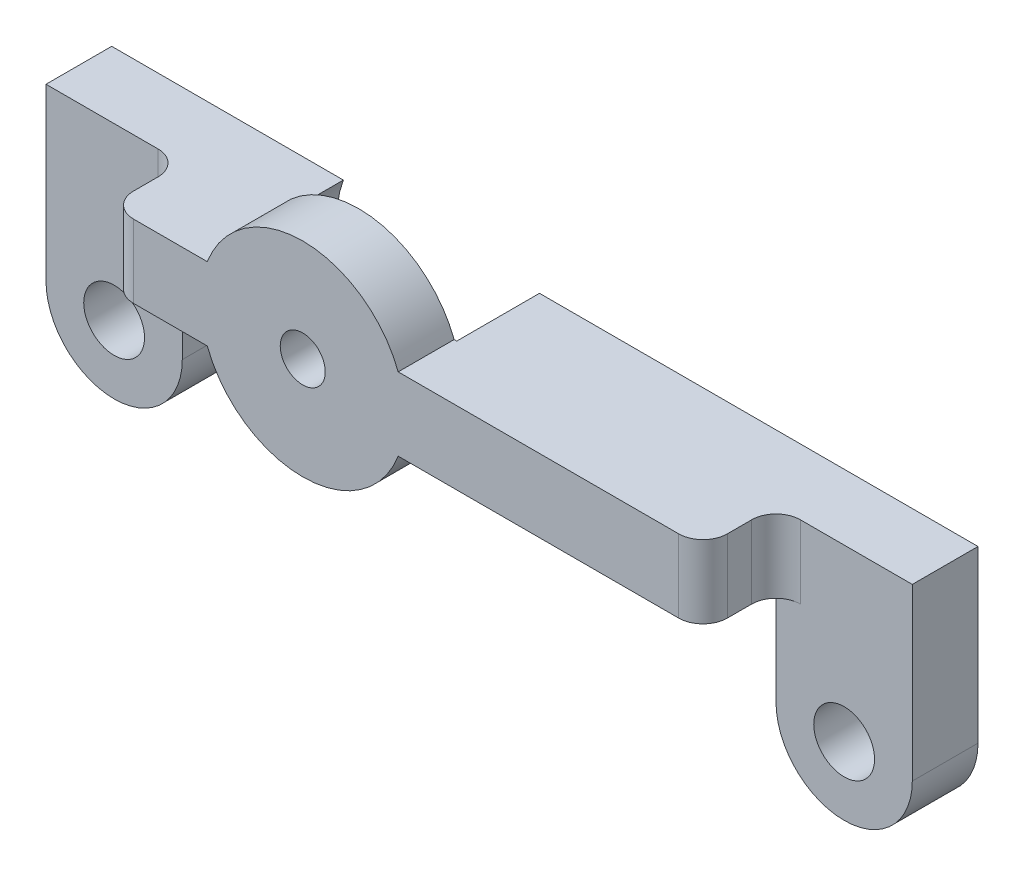
ISO-10303-21;
HEADER;
FILE_DESCRIPTION(('STEP AP214'),'2;1');
FILE_NAME('part.step','',(''),(''),'','','');
FILE_SCHEMA(('AUTOMOTIVE_DESIGN { 1 0 10303 214 1 1 1 1 }'));
ENDSEC;
DATA;
#1=APPLICATION_CONTEXT('core data for automotive mechanical design processes');
#2=APPLICATION_PROTOCOL_DEFINITION('international standard','automotive_design',2000,#1);
#3=PRODUCT_CONTEXT('',#1,'mechanical');
#4=PRODUCT('Part','Part','',(#3));
#5=PRODUCT_RELATED_PRODUCT_CATEGORY('part','',(#4));
#6=PRODUCT_DEFINITION_FORMATION('','',#4);
#7=PRODUCT_DEFINITION_CONTEXT('part definition',#1,'design');
#8=PRODUCT_DEFINITION('design','',#6,#7);
#9=PRODUCT_DEFINITION_SHAPE('','',#8);
#10=(LENGTH_UNIT() NAMED_UNIT(*) SI_UNIT(.MILLI.,.METRE.));
#11=(NAMED_UNIT(*) PLANE_ANGLE_UNIT() SI_UNIT($,.RADIAN.));
#12=(NAMED_UNIT(*) SI_UNIT($,.STERADIAN.) SOLID_ANGLE_UNIT());
#13=UNCERTAINTY_MEASURE_WITH_UNIT(LENGTH_MEASURE(1.E-05),#10,'distance_accuracy_value','');
#14=(GEOMETRIC_REPRESENTATION_CONTEXT(3) GLOBAL_UNCERTAINTY_ASSIGNED_CONTEXT((#13)) GLOBAL_UNIT_ASSIGNED_CONTEXT((#10,
#11,#12)) REPRESENTATION_CONTEXT('',''));
#15=CARTESIAN_POINT('',(0.,0.,0.));
#16=DIRECTION('',(0.,0.,1.));
#17=DIRECTION('',(1.,0.,0.));
#18=AXIS2_PLACEMENT_3D('',#15,#16,#17);
#19=CARTESIAN_POINT('',(-4.24999999999999,-1.06771488469601,7.7));
#20=DIRECTION('',(0.,0.,-1.));
#21=DIRECTION('',(-1.,0.,0.));
#22=AXIS2_PLACEMENT_3D('',#19,#20,#21);
#23=CYLINDRICAL_SURFACE('',#22,4.2);
#24=CARTESIAN_POINT('',(-4.24999999999999,-1.06771488469601,5.7));
#25=DIRECTION('',(0.,0.,1.));
#26=DIRECTION('',(1.,0.,0.));
#27=AXIS2_PLACEMENT_3D('',#24,#25,#26);
#28=CIRCLE('',#27,4.2);
#29=CARTESIAN_POINT('',(-0.326990950813383,0.432285115303986,5.7));
#30=VERTEX_POINT('',#29);
#31=CARTESIAN_POINT('',(-8.1730090491866,0.432285115303986,5.7));
#32=VERTEX_POINT('',#31);
#33=EDGE_CURVE('E213',#30,#32,#28,.T.);
#34=ORIENTED_EDGE('',*,*,#33,.F.);
#35=DIRECTION('',(0.,0.,-1.));
#36=VECTOR('',#35,1.);
#37=CARTESIAN_POINT('',(-0.326990950813383,0.432285115303986,7.7));
#38=LINE('',#37,#36);
#39=CARTESIAN_POINT('',(-0.326990950813383,0.432285115303986,3.4));
#40=VERTEX_POINT('',#39);
#41=EDGE_CURVE('E223',#30,#40,#38,.T.);
#42=ORIENTED_EDGE('',*,*,#41,.T.);
#43=CARTESIAN_POINT('',(-4.24999999999999,-1.06771488469601,3.4));
#44=DIRECTION('',(0.,0.,-1.));
#45=DIRECTION('',(-1.,0.,0.));
#46=AXIS2_PLACEMENT_3D('',#43,#44,#45);
#47=CIRCLE('',#46,4.2);
#48=CARTESIAN_POINT('',(-8.1730090491866,0.432285115303986,3.4));
#49=VERTEX_POINT('',#48);
#50=EDGE_CURVE('E409',#49,#40,#47,.T.);
#51=ORIENTED_EDGE('',*,*,#50,.F.);
#52=DIRECTION('',(0.,0.,-1.));
#53=VECTOR('',#52,1.);
#54=CARTESIAN_POINT('',(-8.1730090491866,0.432285115303986,7.7));
#55=LINE('',#54,#53);
#56=EDGE_CURVE('E225',#32,#49,#55,.T.);
#57=ORIENTED_EDGE('',*,*,#56,.F.);
#58=EDGE_LOOP('',(#34,#42,#51,#57));
#59=FACE_BOUND('',#58,.T.);
#60=ADVANCED_FACE('F50',(#59),#23,.T.);
#61=CARTESIAN_POINT('',(-4.24999999999999,-1.06771488469601,7.7));
#62=DIRECTION('',(0.,0.,-1.));
#63=DIRECTION('',(-1.,0.,0.));
#64=AXIS2_PLACEMENT_3D('',#61,#62,#63);
#65=CYLINDRICAL_SURFACE('',#64,4.2);
#66=CARTESIAN_POINT('',(-4.24999999999999,-1.06771488469601,5.7));
#67=DIRECTION('',(0.,0.,1.));
#68=DIRECTION('',(1.,0.,0.));
#69=AXIS2_PLACEMENT_3D('',#66,#67,#68);
#70=CIRCLE('',#69,4.2);
#71=CARTESIAN_POINT('',(-8.1730090491866,-2.56771488469601,5.7));
#72=VERTEX_POINT('',#71);
#73=CARTESIAN_POINT('',(-0.326990950813383,-2.56771488469601,5.7));
#74=VERTEX_POINT('',#73);
#75=EDGE_CURVE('E474',#72,#74,#70,.T.);
#76=ORIENTED_EDGE('',*,*,#75,.F.);
#77=DIRECTION('',(0.,0.,-1.));
#78=VECTOR('',#77,1.);
#79=CARTESIAN_POINT('',(-8.1730090491866,-2.56771488469601,7.7));
#80=LINE('',#79,#78);
#81=CARTESIAN_POINT('',(-8.1730090491866,-2.56771488469601,3.4));
#82=VERTEX_POINT('',#81);
#83=EDGE_CURVE('E318',#72,#82,#80,.T.);
#84=ORIENTED_EDGE('',*,*,#83,.T.);
#85=CARTESIAN_POINT('',(-4.24999999999999,-1.06771488469601,3.4));
#86=DIRECTION('',(0.,0.,-1.));
#87=DIRECTION('',(-1.,0.,0.));
#88=AXIS2_PLACEMENT_3D('',#85,#86,#87);
#89=CIRCLE('',#88,4.2);
#90=CARTESIAN_POINT('',(-0.326990950813383,-2.56771488469601,3.4));
#91=VERTEX_POINT('',#90);
#92=EDGE_CURVE('E395',#91,#82,#89,.T.);
#93=ORIENTED_EDGE('',*,*,#92,.F.);
#94=DIRECTION('',(0.,0.,-1.));
#95=VECTOR('',#94,1.);
#96=CARTESIAN_POINT('',(-0.326990950813383,-2.56771488469601,7.7));
#97=LINE('',#96,#95);
#98=EDGE_CURVE('E321',#74,#91,#97,.T.);
#99=ORIENTED_EDGE('',*,*,#98,.F.);
#100=EDGE_LOOP('',(#76,#84,#93,#99));
#101=FACE_BOUND('',#100,.T.);
#102=ADVANCED_FACE('F400',(#101),#65,.T.);
#103=CARTESIAN_POINT('',(-4.24999999999999,-1.06771488469601,7.7));
#104=DIRECTION('',(0.,0.,-1.));
#105=DIRECTION('',(-1.,0.,0.));
#106=AXIS2_PLACEMENT_3D('',#103,#104,#105);
#107=CYLINDRICAL_SURFACE('',#106,0.925);
#108=CARTESIAN_POINT('',(-4.24999999999999,-1.06771488469601,3.4));
#109=DIRECTION('',(0.,0.,-1.));
#110=DIRECTION('',(-1.,0.,0.));
#111=AXIS2_PLACEMENT_3D('',#108,#109,#110);
#112=CIRCLE('',#111,0.925);
#113=CARTESIAN_POINT('',(-5.17499999999999,-1.06771488469601,3.4));
#114=VERTEX_POINT('',#113);
#115=EDGE_CURVE('E241',#114,#114,#112,.T.);
#116=ORIENTED_EDGE('',*,*,#115,.T.);
#117=EDGE_LOOP('',(#116));
#118=FACE_BOUND('',#117,.T.);
#119=CARTESIAN_POINT('',(-4.24999999999999,-1.06771488469601,5.7));
#120=DIRECTION('',(0.,0.,1.));
#121=DIRECTION('',(1.,0.,0.));
#122=AXIS2_PLACEMENT_3D('',#119,#120,#121);
#123=CIRCLE('',#122,0.925);
#124=CARTESIAN_POINT('',(-3.32499999999999,-1.06771488469601,5.7));
#125=VERTEX_POINT('',#124);
#126=EDGE_CURVE('E479',#125,#125,#123,.T.);
#127=ORIENTED_EDGE('',*,*,#126,.T.);
#128=EDGE_LOOP('',(#127));
#129=FACE_BOUND('',#128,.T.);
#130=ADVANCED_FACE('F442',(#118,#129),#107,.F.);
#131=CARTESIAN_POINT('',(0.,0.432285115303986,7.7));
#132=DIRECTION('',(0.,-1.,0.));
#133=DIRECTION('',(0.,0.,-1.));
#134=AXIS2_PLACEMENT_3D('',#131,#132,#133);
#135=PLANE('',#134);
#136=DIRECTION('',(-1.,0.,0.));
#137=VECTOR('',#136,1.);
#138=CARTESIAN_POINT('',(12.2,0.432285115303986,5.7));
#139=LINE('',#138,#137);
#140=CARTESIAN_POINT('',(11.2,0.432285115303986,5.7));
#141=VERTEX_POINT('',#140);
#142=EDGE_CURVE('E208',#141,#30,#139,.T.);
#143=ORIENTED_EDGE('',*,*,#142,.F.);
#144=CARTESIAN_POINT('',(11.2,0.432285115303986,4.7));
#145=DIRECTION('',(0.,-1.,0.));
#146=DIRECTION('',(0.,0.,-1.));
#147=AXIS2_PLACEMENT_3D('',#144,#145,#146);
#148=CIRCLE('',#147,1.);
#149=CARTESIAN_POINT('',(12.2,0.432285115303986,4.7));
#150=VERTEX_POINT('',#149);
#151=EDGE_CURVE('E255',#141,#150,#148,.F.);
#152=ORIENTED_EDGE('',*,*,#151,.T.);
#153=DIRECTION('',(0.,0.,1.));
#154=VECTOR('',#153,1.);
#155=CARTESIAN_POINT('',(12.2,0.432285115303986,2.7));
#156=LINE('',#155,#154);
#157=CARTESIAN_POINT('',(12.2,0.432285115303986,3.7));
#158=VERTEX_POINT('',#157);
#159=EDGE_CURVE('E491',#158,#150,#156,.T.);
#160=ORIENTED_EDGE('',*,*,#159,.F.);
#161=CARTESIAN_POINT('',(13.2,0.432285115303986,3.7));
#162=DIRECTION('',(0.,-1.,0.));
#163=DIRECTION('',(0.,0.,-1.));
#164=AXIS2_PLACEMENT_3D('',#161,#162,#163);
#165=CIRCLE('',#164,1.);
#166=CARTESIAN_POINT('',(13.2,0.432285115303986,2.7));
#167=VERTEX_POINT('',#166);
#168=EDGE_CURVE('E282',#158,#167,#165,.T.);
#169=ORIENTED_EDGE('',*,*,#168,.T.);
#170=DIRECTION('',(-1.,0.,0.));
#171=VECTOR('',#170,1.);
#172=CARTESIAN_POINT('',(12.2,0.432285115303986,2.7));
#173=LINE('',#172,#171);
#174=CARTESIAN_POINT('',(17.8,0.432285115303986,2.7));
#175=VERTEX_POINT('',#174);
#176=EDGE_CURVE('E488',#175,#167,#173,.T.);
#177=ORIENTED_EDGE('',*,*,#176,.F.);
#178=DIRECTION('',(0.,0.,-1.));
#179=VECTOR('',#178,1.);
#180=CARTESIAN_POINT('',(17.8,0.432285115303986,7.7));
#181=LINE('',#180,#179);
#182=CARTESIAN_POINT('',(17.8,0.432285115303986,0.));
#183=VERTEX_POINT('',#182);
#184=EDGE_CURVE('E370',#175,#183,#181,.T.);
#185=ORIENTED_EDGE('',*,*,#184,.T.);
#186=DIRECTION('',(-1.,0.,0.));
#187=VECTOR('',#186,1.);
#188=CARTESIAN_POINT('',(0.,0.432285115303986,0.));
#189=LINE('',#188,#187);
#190=CARTESIAN_POINT('',(-0.220111664078011,0.432285115303986,0.));
#191=VERTEX_POINT('',#190);
#192=EDGE_CURVE('E347',#183,#191,#189,.T.);
#193=ORIENTED_EDGE('',*,*,#192,.T.);
#194=DIRECTION('',(0.,0.,-1.));
#195=VECTOR('',#194,1.);
#196=CARTESIAN_POINT('',(-0.220111664078012,0.432285115303986,3.4));
#197=LINE('',#196,#195);
#198=CARTESIAN_POINT('',(-0.220111664078011,0.432285115303986,3.4));
#199=VERTEX_POINT('',#198);
#200=EDGE_CURVE('E245',#191,#199,#197,.F.);
#201=ORIENTED_EDGE('',*,*,#200,.T.);
#202=DIRECTION('',(1.,0.,0.));
#203=VECTOR('',#202,1.);
#204=CARTESIAN_POINT('',(0.,0.432285115303986,3.4));
#205=LINE('',#204,#203);
#206=EDGE_CURVE('E231',#40,#199,#205,.T.);
#207=ORIENTED_EDGE('',*,*,#206,.F.);
#208=ORIENTED_EDGE('',*,*,#41,.F.);
#209=EDGE_LOOP('',(#143,#152,#160,#169,#177,#185,#193,#201,#207,#208));
#210=FACE_BOUND('',#209,.T.);
#211=ADVANCED_FACE('F229',(#210),#135,.F.);
#212=CARTESIAN_POINT('',(0.,0.432285115303986,7.7));
#213=DIRECTION('',(0.,1.,0.));
#214=DIRECTION('',(0.,0.,1.));
#215=AXIS2_PLACEMENT_3D('',#212,#213,#214);
#216=PLANE('',#215);
#217=DIRECTION('',(0.,0.,1.));
#218=VECTOR('',#217,1.);
#219=CARTESIAN_POINT('',(-12.2,0.432285115303986,2.7));
#220=LINE('',#219,#218);
#221=CARTESIAN_POINT('',(-12.2,0.432285115303986,3.7));
#222=VERTEX_POINT('',#221);
#223=CARTESIAN_POINT('',(-12.2,0.432285115303986,4.7));
#224=VERTEX_POINT('',#223);
#225=EDGE_CURVE('E250',#222,#224,#220,.T.);
#226=ORIENTED_EDGE('',*,*,#225,.T.);
#227=CARTESIAN_POINT('',(-11.2,0.432285115303986,4.7));
#228=DIRECTION('',(0.,1.,0.));
#229=DIRECTION('',(0.,0.,1.));
#230=AXIS2_PLACEMENT_3D('',#227,#228,#229);
#231=CIRCLE('',#230,1.);
#232=CARTESIAN_POINT('',(-11.2,0.432285115303986,5.7));
#233=VERTEX_POINT('',#232);
#234=EDGE_CURVE('E274',#224,#233,#231,.T.);
#235=ORIENTED_EDGE('',*,*,#234,.T.);
#236=DIRECTION('',(-1.,0.,0.));
#237=VECTOR('',#236,1.);
#238=CARTESIAN_POINT('',(-12.2,0.432285115303986,5.7));
#239=LINE('',#238,#237);
#240=EDGE_CURVE('E226',#32,#233,#239,.T.);
#241=ORIENTED_EDGE('',*,*,#240,.F.);
#242=ORIENTED_EDGE('',*,*,#56,.T.);
#243=DIRECTION('',(-1.,0.,0.));
#244=VECTOR('',#243,1.);
#245=CARTESIAN_POINT('',(0.,0.432285115303986,3.4));
#246=LINE('',#245,#244);
#247=CARTESIAN_POINT('',(-8.27988833592197,0.432285115303986,3.4));
#248=VERTEX_POINT('',#247);
#249=EDGE_CURVE('E404',#49,#248,#246,.T.);
#250=ORIENTED_EDGE('',*,*,#249,.T.);
#251=DIRECTION('',(0.,0.,-1.));
#252=VECTOR('',#251,1.);
#253=CARTESIAN_POINT('',(-8.27988833592197,0.432285115303986,3.4));
#254=LINE('',#253,#252);
#255=CARTESIAN_POINT('',(-8.27988833592197,0.432285115303986,0.));
#256=VERTEX_POINT('',#255);
#257=EDGE_CURVE('E346',#256,#248,#254,.F.);
#258=ORIENTED_EDGE('',*,*,#257,.F.);
#259=DIRECTION('',(1.,0.,0.));
#260=VECTOR('',#259,1.);
#261=CARTESIAN_POINT('',(0.,0.432285115303986,0.));
#262=LINE('',#261,#260);
#263=CARTESIAN_POINT('',(-17.8,0.432285115303986,0.));
#264=VERTEX_POINT('',#263);
#265=EDGE_CURVE('E340',#264,#256,#262,.T.);
#266=ORIENTED_EDGE('',*,*,#265,.F.);
#267=DIRECTION('',(0.,0.,-1.));
#268=VECTOR('',#267,1.);
#269=CARTESIAN_POINT('',(-17.8,0.432285115303986,7.7));
#270=LINE('',#269,#268);
#271=CARTESIAN_POINT('',(-17.8,0.432285115303986,2.7));
#272=VERTEX_POINT('',#271);
#273=EDGE_CURVE('E237',#272,#264,#270,.T.);
#274=ORIENTED_EDGE('',*,*,#273,.F.);
#275=DIRECTION('',(-1.,0.,0.));
#276=VECTOR('',#275,1.);
#277=CARTESIAN_POINT('',(-17.8,0.432285115303986,2.7));
#278=LINE('',#277,#276);
#279=CARTESIAN_POINT('',(-13.2,0.432285115303986,2.7));
#280=VERTEX_POINT('',#279);
#281=EDGE_CURVE('E290',#280,#272,#278,.T.);
#282=ORIENTED_EDGE('',*,*,#281,.F.);
#283=CARTESIAN_POINT('',(-13.2,0.432285115303986,3.7));
#284=DIRECTION('',(0.,1.,0.));
#285=DIRECTION('',(0.,0.,1.));
#286=AXIS2_PLACEMENT_3D('',#283,#284,#285);
#287=CIRCLE('',#286,1.);
#288=EDGE_CURVE('E58',#280,#222,#287,.F.);
#289=ORIENTED_EDGE('',*,*,#288,.T.);
#290=EDGE_LOOP('',(#226,#235,#241,#242,#250,#258,#266,#274,#282,#289));
#291=FACE_BOUND('',#290,.T.);
#292=ADVANCED_FACE('F287',(#291),#216,.T.);
#293=CARTESIAN_POINT('',(0.,-2.56771488469601,7.7));
#294=DIRECTION('',(0.,1.,0.));
#295=DIRECTION('',(0.,0.,1.));
#296=AXIS2_PLACEMENT_3D('',#293,#294,#295);
#297=PLANE('',#296);
#298=DIRECTION('',(1.,0.,0.));
#299=VECTOR('',#298,1.);
#300=CARTESIAN_POINT('',(-12.2,-2.56771488469601,5.7));
#301=LINE('',#300,#299);
#302=CARTESIAN_POINT('',(-11.2,-2.56771488469601,5.7));
#303=VERTEX_POINT('',#302);
#304=EDGE_CURVE('E472',#303,#72,#301,.T.);
#305=ORIENTED_EDGE('',*,*,#304,.F.);
#306=CARTESIAN_POINT('',(-11.2,-2.56771488469601,4.7));
#307=DIRECTION('',(0.,1.,0.));
#308=DIRECTION('',(0.,0.,1.));
#309=AXIS2_PLACEMENT_3D('',#306,#307,#308);
#310=CIRCLE('',#309,1.);
#311=CARTESIAN_POINT('',(-12.2,-2.56771488469601,4.7));
#312=VERTEX_POINT('',#311);
#313=EDGE_CURVE('E268',#303,#312,#310,.F.);
#314=ORIENTED_EDGE('',*,*,#313,.T.);
#315=DIRECTION('',(0.,0.,-1.));
#316=VECTOR('',#315,1.);
#317=CARTESIAN_POINT('',(-12.2,-2.56771488469601,7.7));
#318=LINE('',#317,#316);
#319=CARTESIAN_POINT('',(-12.2,-2.56771488469601,3.7));
#320=VERTEX_POINT('',#319);
#321=EDGE_CURVE('E317',#312,#320,#318,.T.);
#322=ORIENTED_EDGE('',*,*,#321,.T.);
#323=CARTESIAN_POINT('',(-13.2,-2.56771488469601,3.7));
#324=DIRECTION('',(0.,1.,0.));
#325=DIRECTION('',(0.,0.,1.));
#326=AXIS2_PLACEMENT_3D('',#323,#324,#325);
#327=CIRCLE('',#326,1.);
#328=CARTESIAN_POINT('',(-13.2,-2.56771488469601,2.7));
#329=VERTEX_POINT('',#328);
#330=EDGE_CURVE('E13',#320,#329,#327,.T.);
#331=ORIENTED_EDGE('',*,*,#330,.T.);
#332=DIRECTION('',(-1.,0.,0.));
#333=VECTOR('',#332,1.);
#334=CARTESIAN_POINT('',(0.,-2.56771488469601,2.7));
#335=LINE('',#334,#333);
#336=CARTESIAN_POINT('',(-12.2,-2.56771488469601,2.7));
#337=VERTEX_POINT('',#336);
#338=EDGE_CURVE('E64',#337,#329,#335,.T.);
#339=ORIENTED_EDGE('',*,*,#338,.F.);
#340=CARTESIAN_POINT('',(-12.2,-2.56771488469601,0.));
#341=VERTEX_POINT('',#340);
#342=EDGE_CURVE('E311',#337,#341,#318,.T.);
#343=ORIENTED_EDGE('',*,*,#342,.T.);
#344=DIRECTION('',(1.,0.,0.));
#345=VECTOR('',#344,1.);
#346=CARTESIAN_POINT('',(0.,-2.56771488469601,0.));
#347=LINE('',#346,#345);
#348=CARTESIAN_POINT('',(-8.27988833592197,-2.56771488469601,0.));
#349=VERTEX_POINT('',#348);
#350=EDGE_CURVE('E356',#341,#349,#347,.T.);
#351=ORIENTED_EDGE('',*,*,#350,.T.);
#352=DIRECTION('',(0.,0.,-1.));
#353=VECTOR('',#352,1.);
#354=CARTESIAN_POINT('',(-8.27988833592197,-2.56771488469601,3.4));
#355=LINE('',#354,#353);
#356=CARTESIAN_POINT('',(-8.27988833592197,-2.56771488469601,3.4));
#357=VERTEX_POINT('',#356);
#358=EDGE_CURVE('E504',#349,#357,#355,.F.);
#359=ORIENTED_EDGE('',*,*,#358,.T.);
#360=DIRECTION('',(-1.,0.,0.));
#361=VECTOR('',#360,1.);
#362=CARTESIAN_POINT('',(0.,-2.56771488469601,3.4));
#363=LINE('',#362,#361);
#364=EDGE_CURVE('E402',#82,#357,#363,.T.);
#365=ORIENTED_EDGE('',*,*,#364,.F.);
#366=ORIENTED_EDGE('',*,*,#83,.F.);
#367=EDGE_LOOP('',(#305,#314,#322,#331,#339,#343,#351,#359,#365,#366));
#368=FACE_BOUND('',#367,.T.);
#369=ADVANCED_FACE('F451',(#368),#297,.F.);
#370=CARTESIAN_POINT('',(0.,-2.56771488469601,7.7));
#371=DIRECTION('',(0.,-1.,0.));
#372=DIRECTION('',(0.,0.,-1.));
#373=AXIS2_PLACEMENT_3D('',#370,#371,#372);
#374=PLANE('',#373);
#375=DIRECTION('',(0.,0.,-1.));
#376=VECTOR('',#375,1.);
#377=CARTESIAN_POINT('',(12.2,-2.56771488469601,7.7));
#378=LINE('',#377,#376);
#379=CARTESIAN_POINT('',(12.2,-2.56771488469601,4.7));
#380=VERTEX_POINT('',#379);
#381=CARTESIAN_POINT('',(12.2,-2.56771488469601,3.7));
#382=VERTEX_POINT('',#381);
#383=EDGE_CURVE('E377',#380,#382,#378,.T.);
#384=ORIENTED_EDGE('',*,*,#383,.F.);
#385=CARTESIAN_POINT('',(11.2,-2.56771488469601,4.7));
#386=DIRECTION('',(0.,-1.,0.));
#387=DIRECTION('',(0.,0.,-1.));
#388=AXIS2_PLACEMENT_3D('',#385,#386,#387);
#389=CIRCLE('',#388,1.);
#390=CARTESIAN_POINT('',(11.2,-2.56771488469601,5.7));
#391=VERTEX_POINT('',#390);
#392=EDGE_CURVE('E261',#380,#391,#389,.T.);
#393=ORIENTED_EDGE('',*,*,#392,.T.);
#394=DIRECTION('',(1.,0.,0.));
#395=VECTOR('',#394,1.);
#396=CARTESIAN_POINT('',(12.2,-2.56771488469601,5.7));
#397=LINE('',#396,#395);
#398=EDGE_CURVE('E387',#74,#391,#397,.T.);
#399=ORIENTED_EDGE('',*,*,#398,.F.);
#400=ORIENTED_EDGE('',*,*,#98,.T.);
#401=DIRECTION('',(1.,0.,0.));
#402=VECTOR('',#401,1.);
#403=CARTESIAN_POINT('',(0.,-2.56771488469601,3.4));
#404=LINE('',#403,#402);
#405=CARTESIAN_POINT('',(-0.220111664078011,-2.56771488469601,3.4));
#406=VERTEX_POINT('',#405);
#407=EDGE_CURVE('E244',#91,#406,#404,.T.);
#408=ORIENTED_EDGE('',*,*,#407,.T.);
#409=DIRECTION('',(0.,0.,-1.));
#410=VECTOR('',#409,1.);
#411=CARTESIAN_POINT('',(-0.220111664078012,-2.56771488469601,3.4));
#412=LINE('',#411,#410);
#413=CARTESIAN_POINT('',(-0.22011166407801,-2.56771488469601,0.));
#414=VERTEX_POINT('',#413);
#415=EDGE_CURVE('E502',#414,#406,#412,.F.);
#416=ORIENTED_EDGE('',*,*,#415,.F.);
#417=DIRECTION('',(-1.,0.,0.));
#418=VECTOR('',#417,1.);
#419=CARTESIAN_POINT('',(0.,-2.56771488469601,0.));
#420=LINE('',#419,#418);
#421=CARTESIAN_POINT('',(12.2,-2.56771488469601,0.));
#422=VERTEX_POINT('',#421);
#423=EDGE_CURVE('E358',#422,#414,#420,.T.);
#424=ORIENTED_EDGE('',*,*,#423,.F.);
#425=CARTESIAN_POINT('',(12.2,-2.56771488469601,2.7));
#426=VERTEX_POINT('',#425);
#427=EDGE_CURVE('E376',#426,#422,#378,.T.);
#428=ORIENTED_EDGE('',*,*,#427,.F.);
#429=DIRECTION('',(-1.,0.,0.));
#430=VECTOR('',#429,1.);
#431=CARTESIAN_POINT('',(15.,-2.56771488469601,2.7));
#432=LINE('',#431,#430);
#433=CARTESIAN_POINT('',(13.2,-2.56771488469601,2.7));
#434=VERTEX_POINT('',#433);
#435=EDGE_CURVE('E263',#434,#426,#432,.T.);
#436=ORIENTED_EDGE('',*,*,#435,.F.);
#437=CARTESIAN_POINT('',(13.2,-2.56771488469601,3.7));
#438=DIRECTION('',(0.,-1.,0.));
#439=DIRECTION('',(0.,0.,-1.));
#440=AXIS2_PLACEMENT_3D('',#437,#438,#439);
#441=CIRCLE('',#440,1.);
#442=EDGE_CURVE('E280',#434,#382,#441,.F.);
#443=ORIENTED_EDGE('',*,*,#442,.T.);
#444=EDGE_LOOP('',(#384,#393,#399,#400,#408,#416,#424,#428,#436,#443));
#445=FACE_BOUND('',#444,.T.);
#446=ADVANCED_FACE('F385',(#445),#374,.T.);
#447=CARTESIAN_POINT('',(-12.2,0.432285115303986,2.7));
#448=DIRECTION('',(1.,0.,0.));
#449=DIRECTION('',(0.,1.,0.));
#450=AXIS2_PLACEMENT_3D('',#447,#448,#449);
#451=PLANE('',#450);
#452=ORIENTED_EDGE('',*,*,#321,.F.);
#453=DIRECTION('',(0.,-1.,0.));
#454=VECTOR('',#453,1.);
#455=CARTESIAN_POINT('',(-12.2,0.432285115303986,4.7));
#456=LINE('',#455,#454);
#457=EDGE_CURVE('E272',#312,#224,#456,.F.);
#458=ORIENTED_EDGE('',*,*,#457,.T.);
#459=ORIENTED_EDGE('',*,*,#225,.F.);
#460=DIRECTION('',(0.,1.,0.));
#461=VECTOR('',#460,1.);
#462=CARTESIAN_POINT('',(-12.2,-2.56771488469601,3.7));
#463=LINE('',#462,#461);
#464=EDGE_CURVE('E270',#222,#320,#463,.F.);
#465=ORIENTED_EDGE('',*,*,#464,.T.);
#466=EDGE_LOOP('',(#452,#458,#459,#465));
#467=FACE_BOUND('',#466,.T.);
#468=ADVANCED_FACE('F296',(#467),#451,.F.);
#469=CARTESIAN_POINT('',(12.2,-6.56771488469601,2.7));
#470=DIRECTION('',(-1.,0.,0.));
#471=DIRECTION('',(0.,0.,1.));
#472=AXIS2_PLACEMENT_3D('',#469,#470,#471);
#473=PLANE('',#472);
#474=ORIENTED_EDGE('',*,*,#159,.T.);
#475=DIRECTION('',(0.,1.,0.));
#476=VECTOR('',#475,1.);
#477=CARTESIAN_POINT('',(12.2,-2.56771488469601,4.7));
#478=LINE('',#477,#476);
#479=EDGE_CURVE('E259',#150,#380,#478,.F.);
#480=ORIENTED_EDGE('',*,*,#479,.T.);
#481=ORIENTED_EDGE('',*,*,#383,.T.);
#482=DIRECTION('',(0.,-1.,0.));
#483=VECTOR('',#482,1.);
#484=CARTESIAN_POINT('',(12.2,0.432285115303986,3.7));
#485=LINE('',#484,#483);
#486=EDGE_CURVE('E257',#382,#158,#485,.F.);
#487=ORIENTED_EDGE('',*,*,#486,.T.);
#488=EDGE_LOOP('',(#474,#480,#481,#487));
#489=FACE_BOUND('',#488,.T.);
#490=ADVANCED_FACE('F536',(#489),#473,.F.);
#491=CARTESIAN_POINT('',(0.,0.,0.));
#492=DIRECTION('',(0.,0.,1.));
#493=DIRECTION('',(1.,0.,0.));
#494=AXIS2_PLACEMENT_3D('',#491,#492,#493);
#495=PLANE('',#494);
#496=CARTESIAN_POINT('',(-15.,-6.56771488469601,0.));
#497=DIRECTION('',(0.,0.,1.));
#498=DIRECTION('',(1.,0.,0.));
#499=AXIS2_PLACEMENT_3D('',#496,#497,#498);
#500=CIRCLE('',#499,1.25);
#501=CARTESIAN_POINT('',(-13.75,-6.56771488469601,0.));
#502=VERTEX_POINT('',#501);
#503=EDGE_CURVE('E350',#502,#502,#500,.T.);
#504=ORIENTED_EDGE('',*,*,#503,.T.);
#505=EDGE_LOOP('',(#504));
#506=FACE_BOUND('',#505,.T.);
#507=ORIENTED_EDGE('',*,*,#265,.T.);
#508=CARTESIAN_POINT('',(-4.24999999999999,-1.06771488469601,0.));
#509=DIRECTION('',(0.,0.,1.));
#510=DIRECTION('',(1.,0.,0.));
#511=AXIS2_PLACEMENT_3D('',#508,#509,#510);
#512=CIRCLE('',#511,4.3);
#513=EDGE_CURVE('E235',#256,#349,#512,.T.);
#514=ORIENTED_EDGE('',*,*,#513,.T.);
#515=ORIENTED_EDGE('',*,*,#350,.F.);
#516=DIRECTION('',(0.,1.,0.));
#517=VECTOR('',#516,1.);
#518=CARTESIAN_POINT('',(-12.2,0.,0.));
#519=LINE('',#518,#517);
#520=CARTESIAN_POINT('',(-12.2,-6.56771488469601,0.));
#521=VERTEX_POINT('',#520);
#522=EDGE_CURVE('E314',#521,#341,#519,.T.);
#523=ORIENTED_EDGE('',*,*,#522,.F.);
#524=CARTESIAN_POINT('',(-15.,-6.56771488469601,0.));
#525=DIRECTION('',(0.,0.,1.));
#526=DIRECTION('',(1.,0.,0.));
#527=AXIS2_PLACEMENT_3D('',#524,#525,#526);
#528=CIRCLE('',#527,2.8);
#529=CARTESIAN_POINT('',(-17.8,-6.56771488469601,0.));
#530=VERTEX_POINT('',#529);
#531=EDGE_CURVE('E342',#530,#521,#528,.T.);
#532=ORIENTED_EDGE('',*,*,#531,.F.);
#533=DIRECTION('',(0.,-1.,0.));
#534=VECTOR('',#533,1.);
#535=CARTESIAN_POINT('',(-17.8,0.,0.));
#536=LINE('',#535,#534);
#537=EDGE_CURVE('E332',#264,#530,#536,.T.);
#538=ORIENTED_EDGE('',*,*,#537,.F.);
#539=EDGE_LOOP('',(#507,#514,#515,#523,#532,#538));
#540=FACE_BOUND('',#539,.T.);
#541=ADVANCED_FACE('F338',(#506,#540),#495,.F.);
#542=CARTESIAN_POINT('',(-17.8,0.,7.7));
#543=DIRECTION('',(1.,0.,0.));
#544=DIRECTION('',(0.,0.,-1.));
#545=AXIS2_PLACEMENT_3D('',#542,#543,#544);
#546=PLANE('',#545);
#547=DIRECTION('',(0.,0.,-1.));
#548=VECTOR('',#547,1.);
#549=CARTESIAN_POINT('',(-17.8,-6.56771488469601,7.7));
#550=LINE('',#549,#548);
#551=CARTESIAN_POINT('',(-17.8,-6.56771488469601,2.7));
#552=VERTEX_POINT('',#551);
#553=EDGE_CURVE('E326',#552,#530,#550,.T.);
#554=ORIENTED_EDGE('',*,*,#553,.F.);
#555=DIRECTION('',(0.,-1.,0.));
#556=VECTOR('',#555,1.);
#557=CARTESIAN_POINT('',(-17.8,-6.56771488469601,2.7));
#558=LINE('',#557,#556);
#559=EDGE_CURVE('E334',#272,#552,#558,.T.);
#560=ORIENTED_EDGE('',*,*,#559,.F.);
#561=ORIENTED_EDGE('',*,*,#273,.T.);
#562=ORIENTED_EDGE('',*,*,#537,.T.);
#563=EDGE_LOOP('',(#554,#560,#561,#562));
#564=FACE_BOUND('',#563,.T.);
#565=ADVANCED_FACE('F331',(#564),#546,.F.);
#566=CARTESIAN_POINT('',(-15.,-6.56771488469601,7.7));
#567=DIRECTION('',(0.,0.,-1.));
#568=DIRECTION('',(-1.,0.,0.));
#569=AXIS2_PLACEMENT_3D('',#566,#567,#568);
#570=CYLINDRICAL_SURFACE('',#569,2.8);
#571=DIRECTION('',(0.,0.,-1.));
#572=VECTOR('',#571,1.);
#573=CARTESIAN_POINT('',(-12.2,-6.56771488469601,7.7));
#574=LINE('',#573,#572);
#575=CARTESIAN_POINT('',(-12.2,-6.56771488469601,2.7));
#576=VERTEX_POINT('',#575);
#577=EDGE_CURVE('E320',#576,#521,#574,.T.);
#578=ORIENTED_EDGE('',*,*,#577,.F.);
#579=CARTESIAN_POINT('',(-15.,-6.56771488469601,2.7));
#580=DIRECTION('',(0.,0.,1.));
#581=DIRECTION('',(-1.,0.,0.));
#582=AXIS2_PLACEMENT_3D('',#579,#580,#581);
#583=CIRCLE('',#582,2.8);
#584=EDGE_CURVE('E306',#552,#576,#583,.T.);
#585=ORIENTED_EDGE('',*,*,#584,.F.);
#586=ORIENTED_EDGE('',*,*,#553,.T.);
#587=ORIENTED_EDGE('',*,*,#531,.T.);
#588=EDGE_LOOP('',(#578,#585,#586,#587));
#589=FACE_BOUND('',#588,.T.);
#590=ADVANCED_FACE('F566',(#589),#570,.T.);
#591=CARTESIAN_POINT('',(-12.2,0.,7.7));
#592=DIRECTION('',(-1.,0.,0.));
#593=DIRECTION('',(0.,0.,1.));
#594=AXIS2_PLACEMENT_3D('',#591,#592,#593);
#595=PLANE('',#594);
#596=ORIENTED_EDGE('',*,*,#342,.F.);
#597=DIRECTION('',(0.,1.,0.));
#598=VECTOR('',#597,1.);
#599=CARTESIAN_POINT('',(-12.2,0.432285115303986,2.7));
#600=LINE('',#599,#598);
#601=EDGE_CURVE('E303',#576,#337,#600,.T.);
#602=ORIENTED_EDGE('',*,*,#601,.F.);
#603=ORIENTED_EDGE('',*,*,#577,.T.);
#604=ORIENTED_EDGE('',*,*,#522,.T.);
#605=EDGE_LOOP('',(#596,#602,#603,#604));
#606=FACE_BOUND('',#605,.T.);
#607=ADVANCED_FACE('F312',(#606),#595,.F.);
#608=CARTESIAN_POINT('',(12.2,0.,7.7));
#609=DIRECTION('',(-1.,0.,0.));
#610=DIRECTION('',(0.,0.,1.));
#611=AXIS2_PLACEMENT_3D('',#608,#609,#610);
#612=PLANE('',#611);
#613=DIRECTION('',(0.,-1.,0.));
#614=VECTOR('',#613,1.);
#615=CARTESIAN_POINT('',(12.2,-6.56771488469601,2.7));
#616=LINE('',#615,#614);
#617=CARTESIAN_POINT('',(12.2,-6.56771488469601,2.7));
#618=VERTEX_POINT('',#617);
#619=EDGE_CURVE('E482',#426,#618,#616,.T.);
#620=ORIENTED_EDGE('',*,*,#619,.F.);
#621=ORIENTED_EDGE('',*,*,#427,.T.);
#622=DIRECTION('',(0.,1.,0.));
#623=VECTOR('',#622,1.);
#624=CARTESIAN_POINT('',(12.2,0.,0.));
#625=LINE('',#624,#623);
#626=CARTESIAN_POINT('',(12.2,-6.56771488469601,0.));
#627=VERTEX_POINT('',#626);
#628=EDGE_CURVE('E361',#627,#422,#625,.T.);
#629=ORIENTED_EDGE('',*,*,#628,.F.);
#630=DIRECTION('',(0.,0.,-1.));
#631=VECTOR('',#630,1.);
#632=CARTESIAN_POINT('',(12.2,-6.56771488469601,7.7));
#633=LINE('',#632,#631);
#634=EDGE_CURVE('E374',#618,#627,#633,.T.);
#635=ORIENTED_EDGE('',*,*,#634,.F.);
#636=EDGE_LOOP('',(#620,#621,#629,#635));
#637=FACE_BOUND('',#636,.T.);
#638=ADVANCED_FACE('F431',(#637),#612,.T.);
#639=CARTESIAN_POINT('',(15.,-6.56771488469601,7.7));
#640=DIRECTION('',(0.,0.,-1.));
#641=DIRECTION('',(-1.,0.,0.));
#642=AXIS2_PLACEMENT_3D('',#639,#640,#641);
#643=CYLINDRICAL_SURFACE('',#642,2.8);
#644=CARTESIAN_POINT('',(15.,-6.56771488469601,2.7));
#645=DIRECTION('',(0.,0.,1.));
#646=DIRECTION('',(-1.,0.,0.));
#647=AXIS2_PLACEMENT_3D('',#644,#645,#646);
#648=CIRCLE('',#647,2.8);
#649=CARTESIAN_POINT('',(17.8,-6.56771488469601,2.7));
#650=VERTEX_POINT('',#649);
#651=EDGE_CURVE('E484',#618,#650,#648,.T.);
#652=ORIENTED_EDGE('',*,*,#651,.F.);
#653=ORIENTED_EDGE('',*,*,#634,.T.);
#654=CARTESIAN_POINT('',(15.,-6.56771488469601,0.));
#655=DIRECTION('',(0.,0.,1.));
#656=DIRECTION('',(1.,0.,0.));
#657=AXIS2_PLACEMENT_3D('',#654,#655,#656);
#658=CIRCLE('',#657,2.8);
#659=CARTESIAN_POINT('',(17.8,-6.56771488469601,0.));
#660=VERTEX_POINT('',#659);
#661=EDGE_CURVE('E364',#660,#627,#658,.F.);
#662=ORIENTED_EDGE('',*,*,#661,.F.);
#663=DIRECTION('',(0.,0.,-1.));
#664=VECTOR('',#663,1.);
#665=CARTESIAN_POINT('',(17.8,-6.56771488469601,7.7));
#666=LINE('',#665,#664);
#667=EDGE_CURVE('E372',#650,#660,#666,.T.);
#668=ORIENTED_EDGE('',*,*,#667,.F.);
#669=EDGE_LOOP('',(#652,#653,#662,#668));
#670=FACE_BOUND('',#669,.T.);
#671=ADVANCED_FACE('F421',(#670),#643,.T.);
#672=CARTESIAN_POINT('',(-15.,-6.56771488469601,7.7));
#673=DIRECTION('',(0.,0.,-1.));
#674=DIRECTION('',(-1.,0.,0.));
#675=AXIS2_PLACEMENT_3D('',#672,#673,#674);
#676=CYLINDRICAL_SURFACE('',#675,1.25);
#677=CARTESIAN_POINT('',(-15.,-6.56771488469601,2.7));
#678=DIRECTION('',(0.,0.,-1.));
#679=DIRECTION('',(-1.,0.,0.));
#680=AXIS2_PLACEMENT_3D('',#677,#678,#679);
#681=CIRCLE('',#680,1.25);
#682=CARTESIAN_POINT('',(-16.25,-6.56771488469601,2.7));
#683=VERTEX_POINT('',#682);
#684=EDGE_CURVE('E246',#683,#683,#681,.T.);
#685=ORIENTED_EDGE('',*,*,#684,.F.);
#686=EDGE_LOOP('',(#685));
#687=FACE_BOUND('',#686,.T.);
#688=ORIENTED_EDGE('',*,*,#503,.F.);
#689=EDGE_LOOP('',(#688));
#690=FACE_BOUND('',#689,.T.);
#691=ADVANCED_FACE('F418',(#687,#690),#676,.F.);
#692=CARTESIAN_POINT('',(15.,-6.56771488469601,7.7));
#693=DIRECTION('',(0.,0.,-1.));
#694=DIRECTION('',(-1.,0.,0.));
#695=AXIS2_PLACEMENT_3D('',#692,#693,#694);
#696=CYLINDRICAL_SURFACE('',#695,1.25);
#697=CARTESIAN_POINT('',(15.,-6.56771488469601,2.7));
#698=DIRECTION('',(0.,0.,-1.));
#699=DIRECTION('',(-1.,0.,0.));
#700=AXIS2_PLACEMENT_3D('',#697,#698,#699);
#701=CIRCLE('',#700,1.25);
#702=CARTESIAN_POINT('',(13.75,-6.56771488469601,2.7));
#703=VERTEX_POINT('',#702);
#704=EDGE_CURVE('E494',#703,#703,#701,.F.);
#705=ORIENTED_EDGE('',*,*,#704,.T.);
#706=EDGE_LOOP('',(#705));
#707=FACE_BOUND('',#706,.T.);
#708=CARTESIAN_POINT('',(15.,-6.56771488469601,0.));
#709=DIRECTION('',(0.,0.,1.));
#710=DIRECTION('',(1.,0.,0.));
#711=AXIS2_PLACEMENT_3D('',#708,#709,#710);
#712=CIRCLE('',#711,1.25);
#713=CARTESIAN_POINT('',(16.25,-6.56771488469601,0.));
#714=VERTEX_POINT('',#713);
#715=EDGE_CURVE('E412',#714,#714,#712,.F.);
#716=ORIENTED_EDGE('',*,*,#715,.T.);
#717=EDGE_LOOP('',(#716));
#718=FACE_BOUND('',#717,.T.);
#719=ADVANCED_FACE('F420',(#707,#718),#696,.F.);
#720=CARTESIAN_POINT('',(17.8,0.,7.7));
#721=DIRECTION('',(1.,0.,0.));
#722=DIRECTION('',(0.,0.,-1.));
#723=AXIS2_PLACEMENT_3D('',#720,#721,#722);
#724=PLANE('',#723);
#725=DIRECTION('',(0.,1.,0.));
#726=VECTOR('',#725,1.);
#727=CARTESIAN_POINT('',(17.8,0.432285115303986,2.7));
#728=LINE('',#727,#726);
#729=EDGE_CURVE('E486',#650,#175,#728,.T.);
#730=ORIENTED_EDGE('',*,*,#729,.F.);
#731=ORIENTED_EDGE('',*,*,#667,.T.);
#732=DIRECTION('',(0.,-1.,0.));
#733=VECTOR('',#732,1.);
#734=CARTESIAN_POINT('',(17.8,0.,0.));
#735=LINE('',#734,#733);
#736=EDGE_CURVE('E367',#183,#660,#735,.T.);
#737=ORIENTED_EDGE('',*,*,#736,.F.);
#738=ORIENTED_EDGE('',*,*,#184,.F.);
#739=EDGE_LOOP('',(#730,#731,#737,#738));
#740=FACE_BOUND('',#739,.T.);
#741=ADVANCED_FACE('F428',(#740),#724,.T.);
#742=ORIENTED_EDGE('',*,*,#715,.F.);
#743=EDGE_LOOP('',(#742));
#744=FACE_BOUND('',#743,.T.);
#745=ORIENTED_EDGE('',*,*,#423,.T.);
#746=EDGE_CURVE('E232',#414,#191,#512,.T.);
#747=ORIENTED_EDGE('',*,*,#746,.T.);
#748=ORIENTED_EDGE('',*,*,#192,.F.);
#749=ORIENTED_EDGE('',*,*,#736,.T.);
#750=ORIENTED_EDGE('',*,*,#661,.T.);
#751=ORIENTED_EDGE('',*,*,#628,.T.);
#752=EDGE_LOOP('',(#745,#747,#748,#749,#750,#751));
#753=FACE_BOUND('',#752,.T.);
#754=ADVANCED_FACE('F511',(#744,#753),#495,.F.);
#755=CARTESIAN_POINT('',(-4.24999999999999,-1.06771488469601,3.4));
#756=DIRECTION('',(0.,0.,-1.));
#757=DIRECTION('',(-1.,0.,0.));
#758=AXIS2_PLACEMENT_3D('',#755,#756,#757);
#759=PLANE('',#758);
#760=ORIENTED_EDGE('',*,*,#115,.F.);
#761=EDGE_LOOP('',(#760));
#762=FACE_BOUND('',#761,.T.);
#763=ORIENTED_EDGE('',*,*,#206,.T.);
#764=CARTESIAN_POINT('',(-4.24999999999999,-1.06771488469601,3.4));
#765=DIRECTION('',(0.,0.,-1.));
#766=DIRECTION('',(-1.,0.,0.));
#767=AXIS2_PLACEMENT_3D('',#764,#765,#766);
#768=CIRCLE('',#767,4.3);
#769=EDGE_CURVE('E398',#199,#406,#768,.T.);
#770=ORIENTED_EDGE('',*,*,#769,.T.);
#771=ORIENTED_EDGE('',*,*,#407,.F.);
#772=ORIENTED_EDGE('',*,*,#92,.T.);
#773=ORIENTED_EDGE('',*,*,#364,.T.);
#774=EDGE_CURVE('E249',#357,#248,#768,.T.);
#775=ORIENTED_EDGE('',*,*,#774,.T.);
#776=ORIENTED_EDGE('',*,*,#249,.F.);
#777=ORIENTED_EDGE('',*,*,#50,.T.);
#778=EDGE_LOOP('',(#763,#770,#771,#772,#773,#775,#776,#777));
#779=FACE_BOUND('',#778,.T.);
#780=ADVANCED_FACE('F394',(#762,#779),#759,.T.);
#781=CARTESIAN_POINT('',(-4.24999999999999,-1.06771488469601,3.4));
#782=DIRECTION('',(0.,0.,-1.));
#783=DIRECTION('',(-1.,0.,0.));
#784=AXIS2_PLACEMENT_3D('',#781,#782,#783);
#785=CYLINDRICAL_SURFACE('',#784,4.3);
#786=ORIENTED_EDGE('',*,*,#746,.F.);
#787=ORIENTED_EDGE('',*,*,#415,.T.);
#788=ORIENTED_EDGE('',*,*,#769,.F.);
#789=ORIENTED_EDGE('',*,*,#200,.F.);
#790=EDGE_LOOP('',(#786,#787,#788,#789));
#791=FACE_BOUND('',#790,.T.);
#792=ADVANCED_FACE('F509',(#791),#785,.F.);
#793=ORIENTED_EDGE('',*,*,#257,.T.);
#794=ORIENTED_EDGE('',*,*,#774,.F.);
#795=ORIENTED_EDGE('',*,*,#358,.F.);
#796=ORIENTED_EDGE('',*,*,#513,.F.);
#797=EDGE_LOOP('',(#793,#794,#795,#796));
#798=FACE_BOUND('',#797,.T.);
#799=ADVANCED_FACE('F541',(#798),#785,.F.);
#800=CARTESIAN_POINT('',(-15.,-6.56771488469601,2.7));
#801=DIRECTION('',(0.,0.,-1.));
#802=DIRECTION('',(-1.,0.,0.));
#803=AXIS2_PLACEMENT_3D('',#800,#801,#802);
#804=PLANE('',#803);
#805=ORIENTED_EDGE('',*,*,#684,.T.);
#806=EDGE_LOOP('',(#805));
#807=FACE_BOUND('',#806,.T.);
#808=ORIENTED_EDGE('',*,*,#338,.T.);
#809=DIRECTION('',(0.,1.,0.));
#810=VECTOR('',#809,1.);
#811=CARTESIAN_POINT('',(-13.2,0.432285115303986,2.7));
#812=LINE('',#811,#810);
#813=EDGE_CURVE('E277',#329,#280,#812,.T.);
#814=ORIENTED_EDGE('',*,*,#813,.T.);
#815=ORIENTED_EDGE('',*,*,#281,.T.);
#816=ORIENTED_EDGE('',*,*,#559,.T.);
#817=ORIENTED_EDGE('',*,*,#584,.T.);
#818=ORIENTED_EDGE('',*,*,#601,.T.);
#819=EDGE_LOOP('',(#808,#814,#815,#816,#817,#818));
#820=FACE_BOUND('',#819,.T.);
#821=ADVANCED_FACE('F300',(#807,#820),#804,.F.);
#822=CARTESIAN_POINT('',(15.,-6.56771488469601,2.7));
#823=DIRECTION('',(0.,0.,-1.));
#824=DIRECTION('',(-1.,0.,0.));
#825=AXIS2_PLACEMENT_3D('',#822,#823,#824);
#826=PLANE('',#825);
#827=ORIENTED_EDGE('',*,*,#176,.T.);
#828=DIRECTION('',(0.,-1.,0.));
#829=VECTOR('',#828,1.);
#830=CARTESIAN_POINT('',(13.2,-2.56771488469601,2.7));
#831=LINE('',#830,#829);
#832=EDGE_CURVE('E265',#167,#434,#831,.T.);
#833=ORIENTED_EDGE('',*,*,#832,.T.);
#834=ORIENTED_EDGE('',*,*,#435,.T.);
#835=ORIENTED_EDGE('',*,*,#619,.T.);
#836=ORIENTED_EDGE('',*,*,#651,.T.);
#837=ORIENTED_EDGE('',*,*,#729,.T.);
#838=EDGE_LOOP('',(#827,#833,#834,#835,#836,#837));
#839=FACE_BOUND('',#838,.T.);
#840=ORIENTED_EDGE('',*,*,#704,.F.);
#841=EDGE_LOOP('',(#840));
#842=FACE_BOUND('',#841,.T.);
#843=ADVANCED_FACE('F522',(#839,#842),#826,.F.);
#844=CARTESIAN_POINT('',(-4.24999999999999,-1.06771488469601,5.7));
#845=DIRECTION('',(0.,0.,1.));
#846=DIRECTION('',(1.,0.,0.));
#847=AXIS2_PLACEMENT_3D('',#844,#845,#846);
#848=PLANE('',#847);
#849=ORIENTED_EDGE('',*,*,#126,.F.);
#850=EDGE_LOOP('',(#849));
#851=FACE_BOUND('',#850,.T.);
#852=ORIENTED_EDGE('',*,*,#398,.T.);
#853=DIRECTION('',(0.,1.,0.));
#854=VECTOR('',#853,1.);
#855=CARTESIAN_POINT('',(11.2,0.432285115303986,5.7));
#856=LINE('',#855,#854);
#857=EDGE_CURVE('E216',#391,#141,#856,.T.);
#858=ORIENTED_EDGE('',*,*,#857,.T.);
#859=ORIENTED_EDGE('',*,*,#142,.T.);
#860=ORIENTED_EDGE('',*,*,#33,.T.);
#861=ORIENTED_EDGE('',*,*,#240,.T.);
#862=DIRECTION('',(0.,-1.,0.));
#863=VECTOR('',#862,1.);
#864=CARTESIAN_POINT('',(-11.2,-2.56771488469601,5.7));
#865=LINE('',#864,#863);
#866=EDGE_CURVE('E251',#233,#303,#865,.T.);
#867=ORIENTED_EDGE('',*,*,#866,.T.);
#868=ORIENTED_EDGE('',*,*,#304,.T.);
#869=ORIENTED_EDGE('',*,*,#75,.T.);
#870=EDGE_LOOP('',(#852,#858,#859,#860,#861,#867,#868,#869));
#871=FACE_BOUND('',#870,.T.);
#872=ADVANCED_FACE('F211',(#851,#871),#848,.T.);
#873=CARTESIAN_POINT('',(11.2,-1.06771488469601,4.7));
#874=DIRECTION('',(0.,-1.,0.));
#875=DIRECTION('',(0.,0.,-1.));
#876=AXIS2_PLACEMENT_3D('',#873,#874,#875);
#877=CYLINDRICAL_SURFACE('',#876,1.);
#878=ORIENTED_EDGE('',*,*,#392,.F.);
#879=ORIENTED_EDGE('',*,*,#479,.F.);
#880=ORIENTED_EDGE('',*,*,#151,.F.);
#881=ORIENTED_EDGE('',*,*,#857,.F.);
#882=EDGE_LOOP('',(#878,#879,#880,#881));
#883=FACE_BOUND('',#882,.T.);
#884=ADVANCED_FACE('F457',(#883),#877,.T.);
#885=CARTESIAN_POINT('',(13.2,-6.56771488469601,3.7));
#886=DIRECTION('',(0.,1.,0.));
#887=DIRECTION('',(0.,0.,1.));
#888=AXIS2_PLACEMENT_3D('',#885,#886,#887);
#889=CYLINDRICAL_SURFACE('',#888,1.);
#890=ORIENTED_EDGE('',*,*,#168,.F.);
#891=ORIENTED_EDGE('',*,*,#486,.F.);
#892=ORIENTED_EDGE('',*,*,#442,.F.);
#893=ORIENTED_EDGE('',*,*,#832,.F.);
#894=EDGE_LOOP('',(#890,#891,#892,#893));
#895=FACE_BOUND('',#894,.T.);
#896=ADVANCED_FACE('F460',(#895),#889,.F.);
#897=CARTESIAN_POINT('',(-11.2,-1.06771488469601,4.7));
#898=DIRECTION('',(0.,1.,0.));
#899=DIRECTION('',(-1.,0.,0.));
#900=AXIS2_PLACEMENT_3D('',#897,#898,#899);
#901=CYLINDRICAL_SURFACE('',#900,1.);
#902=ORIENTED_EDGE('',*,*,#234,.F.);
#903=ORIENTED_EDGE('',*,*,#457,.F.);
#904=ORIENTED_EDGE('',*,*,#313,.F.);
#905=ORIENTED_EDGE('',*,*,#866,.F.);
#906=EDGE_LOOP('',(#902,#903,#904,#905));
#907=FACE_BOUND('',#906,.T.);
#908=ADVANCED_FACE('F463',(#907),#901,.T.);
#909=CARTESIAN_POINT('',(-13.2,-6.56771488469602,3.7));
#910=DIRECTION('',(0.,-1.,0.));
#911=DIRECTION('',(1.,0.,0.));
#912=AXIS2_PLACEMENT_3D('',#909,#910,#911);
#913=CYLINDRICAL_SURFACE('',#912,1.);
#914=ORIENTED_EDGE('',*,*,#330,.F.);
#915=ORIENTED_EDGE('',*,*,#464,.F.);
#916=ORIENTED_EDGE('',*,*,#288,.F.);
#917=ORIENTED_EDGE('',*,*,#813,.F.);
#918=EDGE_LOOP('',(#914,#915,#916,#917));
#919=FACE_BOUND('',#918,.T.);
#920=ADVANCED_FACE('F52',(#919),#913,.F.);
#921=CLOSED_SHELL('',(#60,#102,#130,#211,#292,#369,#446,#468,#490,#541,#565,#590,#607,#638,#671,
#691,#719,#741,#754,#780,#792,#799,#821,#843,#872,#884,#896,#908,#920));
#922=MANIFOLD_SOLID_BREP('B2',#921);
#923=ADVANCED_BREP_SHAPE_REPRESENTATION('',(#18,#922),#14);
#924=SHAPE_DEFINITION_REPRESENTATION(#9,#923);
ENDSEC;
END-ISO-10303-21;
